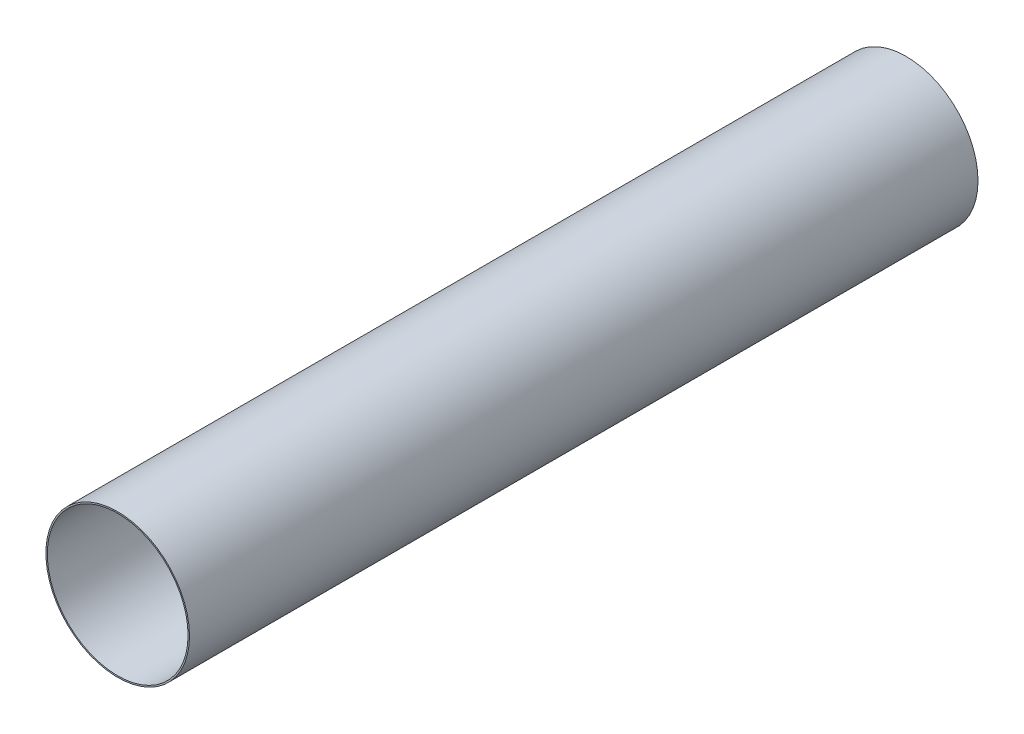
ISO-10303-21;
HEADER;
FILE_DESCRIPTION(('STEP AP214'),'2;1');
FILE_NAME('part.step','',(''),(''),'','','');
FILE_SCHEMA(('AUTOMOTIVE_DESIGN { 1 0 10303 214 1 1 1 1 }'));
ENDSEC;
DATA;
#1=APPLICATION_CONTEXT('core data for automotive mechanical design processes');
#2=APPLICATION_PROTOCOL_DEFINITION('international standard','automotive_design',2000,#1);
#3=PRODUCT_CONTEXT('',#1,'mechanical');
#4=PRODUCT('Part','Part','',(#3));
#5=PRODUCT_RELATED_PRODUCT_CATEGORY('part','',(#4));
#6=PRODUCT_DEFINITION_FORMATION('','',#4);
#7=PRODUCT_DEFINITION_CONTEXT('part definition',#1,'design');
#8=PRODUCT_DEFINITION('design','',#6,#7);
#9=PRODUCT_DEFINITION_SHAPE('','',#8);
#10=(LENGTH_UNIT() NAMED_UNIT(*) SI_UNIT(.MILLI.,.METRE.));
#11=(NAMED_UNIT(*) PLANE_ANGLE_UNIT() SI_UNIT($,.RADIAN.));
#12=(NAMED_UNIT(*) SI_UNIT($,.STERADIAN.) SOLID_ANGLE_UNIT());
#13=UNCERTAINTY_MEASURE_WITH_UNIT(LENGTH_MEASURE(1.E-05),#10,'distance_accuracy_value','');
#14=(GEOMETRIC_REPRESENTATION_CONTEXT(3) GLOBAL_UNCERTAINTY_ASSIGNED_CONTEXT((#13)) GLOBAL_UNIT_ASSIGNED_CONTEXT((#10,
#11,#12)) REPRESENTATION_CONTEXT('',''));
#15=CARTESIAN_POINT('',(0.,0.,0.));
#16=DIRECTION('',(0.,0.,1.));
#17=DIRECTION('',(1.,0.,0.));
#18=AXIS2_PLACEMENT_3D('',#15,#16,#17);
#19=CARTESIAN_POINT('',(0.,0.,355.6));
#20=DIRECTION('',(0.,0.,1.));
#21=DIRECTION('',(1.,0.,0.));
#22=AXIS2_PLACEMENT_3D('',#19,#20,#21);
#23=PLANE('',#22);
#24=CARTESIAN_POINT('',(0.,0.,355.6));
#25=DIRECTION('',(0.,0.,1.));
#26=DIRECTION('',(1.,0.,0.));
#27=AXIS2_PLACEMENT_3D('',#24,#25,#26);
#28=CIRCLE('',#27,32.385);
#29=CARTESIAN_POINT('',(32.385,0.,355.6));
#30=VERTEX_POINT('',#29);
#31=EDGE_CURVE('E10',#30,#30,#28,.T.);
#32=ORIENTED_EDGE('',*,*,#31,.T.);
#33=EDGE_LOOP('',(#32));
#34=FACE_BOUND('',#33,.T.);
#35=CARTESIAN_POINT('',(0.,0.,355.6));
#36=DIRECTION('',(0.,0.,1.));
#37=DIRECTION('',(1.,0.,0.));
#38=AXIS2_PLACEMENT_3D('',#35,#36,#37);
#39=CIRCLE('',#38,31.75);
#40=CARTESIAN_POINT('',(31.75,0.,355.6));
#41=VERTEX_POINT('',#40);
#42=EDGE_CURVE('E44',#41,#41,#39,.T.);
#43=ORIENTED_EDGE('',*,*,#42,.F.);
#44=EDGE_LOOP('',(#43));
#45=FACE_BOUND('',#44,.T.);
#46=ADVANCED_FACE('F33',(#34,#45),#23,.T.);
#47=CARTESIAN_POINT('',(0.,0.,0.));
#48=DIRECTION('',(0.,0.,1.));
#49=DIRECTION('',(1.,0.,0.));
#50=AXIS2_PLACEMENT_3D('',#47,#48,#49);
#51=PLANE('',#50);
#52=CARTESIAN_POINT('',(0.,0.,0.));
#53=DIRECTION('',(0.,0.,1.));
#54=DIRECTION('',(1.,0.,0.));
#55=AXIS2_PLACEMENT_3D('',#52,#53,#54);
#56=CIRCLE('',#55,32.385);
#57=CARTESIAN_POINT('',(32.385,0.,0.));
#58=VERTEX_POINT('',#57);
#59=EDGE_CURVE('E37',#58,#58,#56,.T.);
#60=ORIENTED_EDGE('',*,*,#59,.F.);
#61=EDGE_LOOP('',(#60));
#62=FACE_BOUND('',#61,.T.);
#63=CARTESIAN_POINT('',(0.,0.,0.));
#64=DIRECTION('',(0.,0.,1.));
#65=DIRECTION('',(1.,0.,0.));
#66=AXIS2_PLACEMENT_3D('',#63,#64,#65);
#67=CIRCLE('',#66,31.75);
#68=CARTESIAN_POINT('',(31.75,0.,0.));
#69=VERTEX_POINT('',#68);
#70=EDGE_CURVE('E46',#69,#69,#67,.T.);
#71=ORIENTED_EDGE('',*,*,#70,.T.);
#72=EDGE_LOOP('',(#71));
#73=FACE_BOUND('',#72,.T.);
#74=ADVANCED_FACE('F56',(#62,#73),#51,.F.);
#75=CARTESIAN_POINT('',(0.,0.,355.6));
#76=DIRECTION('',(0.,0.,-1.));
#77=DIRECTION('',(-1.,0.,0.));
#78=AXIS2_PLACEMENT_3D('',#75,#76,#77);
#79=CYLINDRICAL_SURFACE('',#78,32.385);
#80=ORIENTED_EDGE('',*,*,#31,.F.);
#81=EDGE_LOOP('',(#80));
#82=FACE_BOUND('',#81,.T.);
#83=ORIENTED_EDGE('',*,*,#59,.T.);
#84=EDGE_LOOP('',(#83));
#85=FACE_BOUND('',#84,.T.);
#86=ADVANCED_FACE('F35',(#82,#85),#79,.T.);
#87=CARTESIAN_POINT('',(0.,0.,355.6));
#88=DIRECTION('',(0.,0.,-1.));
#89=DIRECTION('',(-1.,0.,0.));
#90=AXIS2_PLACEMENT_3D('',#87,#88,#89);
#91=CYLINDRICAL_SURFACE('',#90,31.75);
#92=ORIENTED_EDGE('',*,*,#42,.T.);
#93=EDGE_LOOP('',(#92));
#94=FACE_BOUND('',#93,.T.);
#95=ORIENTED_EDGE('',*,*,#70,.F.);
#96=EDGE_LOOP('',(#95));
#97=FACE_BOUND('',#96,.T.);
#98=ADVANCED_FACE('F52',(#94,#97),#91,.F.);
#99=CLOSED_SHELL('',(#46,#74,#86,#98));
#100=MANIFOLD_SOLID_BREP('B2',#99);
#101=ADVANCED_BREP_SHAPE_REPRESENTATION('',(#18,#100),#14);
#102=SHAPE_DEFINITION_REPRESENTATION(#9,#101);
ENDSEC;
END-ISO-10303-21;
